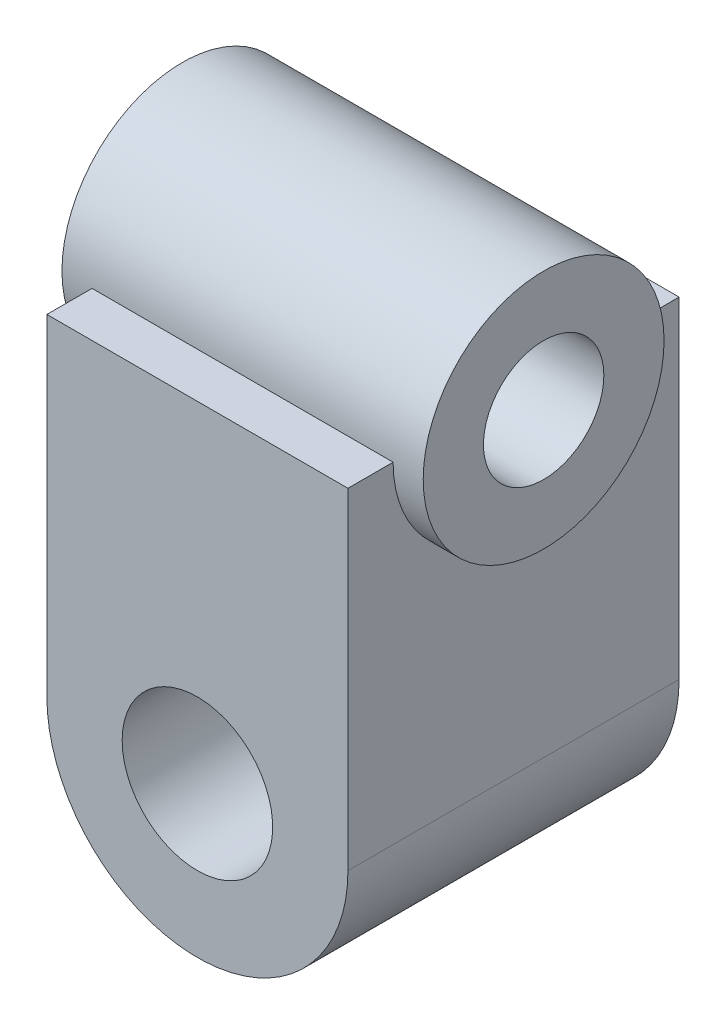
ISO-10303-21;
HEADER;
FILE_DESCRIPTION(('STEP AP214'),'2;1');
FILE_NAME('part.step','',(''),(''),'','','');
FILE_SCHEMA(('AUTOMOTIVE_DESIGN { 1 0 10303 214 1 1 1 1 }'));
ENDSEC;
DATA;
#1=APPLICATION_CONTEXT('core data for automotive mechanical design processes');
#2=APPLICATION_PROTOCOL_DEFINITION('international standard','automotive_design',2000,#1);
#3=PRODUCT_CONTEXT('',#1,'mechanical');
#4=PRODUCT('Part','Part','',(#3));
#5=PRODUCT_RELATED_PRODUCT_CATEGORY('part','',(#4));
#6=PRODUCT_DEFINITION_FORMATION('','',#4);
#7=PRODUCT_DEFINITION_CONTEXT('part definition',#1,'design');
#8=PRODUCT_DEFINITION('design','',#6,#7);
#9=PRODUCT_DEFINITION_SHAPE('','',#8);
#10=(LENGTH_UNIT() NAMED_UNIT(*) SI_UNIT(.MILLI.,.METRE.));
#11=(NAMED_UNIT(*) PLANE_ANGLE_UNIT() SI_UNIT($,.RADIAN.));
#12=(NAMED_UNIT(*) SI_UNIT($,.STERADIAN.) SOLID_ANGLE_UNIT());
#13=UNCERTAINTY_MEASURE_WITH_UNIT(LENGTH_MEASURE(1.E-05),#10,'distance_accuracy_value','');
#14=(GEOMETRIC_REPRESENTATION_CONTEXT(3) GLOBAL_UNCERTAINTY_ASSIGNED_CONTEXT((#13)) GLOBAL_UNIT_ASSIGNED_CONTEXT((#10,
#11,#12)) REPRESENTATION_CONTEXT('',''));
#15=CARTESIAN_POINT('',(0.,0.,0.));
#16=DIRECTION('',(0.,0.,1.));
#17=DIRECTION('',(1.,0.,0.));
#18=AXIS2_PLACEMENT_3D('',#15,#16,#17);
#19=CARTESIAN_POINT('',(0.,69.85,34.925));
#20=DIRECTION('',(0.,1.,0.));
#21=DIRECTION('',(0.,0.,1.));
#22=AXIS2_PLACEMENT_3D('',#19,#20,#21);
#23=PLANE('',#22);
#24=DIRECTION('',(0.,0.,-1.));
#25=VECTOR('',#24,1.);
#26=CARTESIAN_POINT('',(-31.75,69.85,34.925));
#27=LINE('',#26,#25);
#28=CARTESIAN_POINT('',(-31.75,69.85,-25.4));
#29=VERTEX_POINT('',#28);
#30=CARTESIAN_POINT('',(-31.75,69.85,-34.925));
#31=VERTEX_POINT('',#30);
#32=EDGE_CURVE('E78',#29,#31,#27,.T.);
#33=ORIENTED_EDGE('',*,*,#32,.F.);
#34=DIRECTION('',(-1.,0.,0.));
#35=VECTOR('',#34,1.);
#36=CARTESIAN_POINT('',(38.1,69.85,-25.4));
#37=LINE('',#36,#35);
#38=CARTESIAN_POINT('',(31.75,69.85,-25.4));
#39=VERTEX_POINT('',#38);
#40=EDGE_CURVE('E11',#29,#39,#37,.F.);
#41=ORIENTED_EDGE('',*,*,#40,.T.);
#42=DIRECTION('',(0.,0.,-1.));
#43=VECTOR('',#42,1.);
#44=CARTESIAN_POINT('',(31.75,69.85,34.925));
#45=LINE('',#44,#43);
#46=CARTESIAN_POINT('',(31.75,69.85,-34.925));
#47=VERTEX_POINT('',#46);
#48=EDGE_CURVE('E103',#39,#47,#45,.T.);
#49=ORIENTED_EDGE('',*,*,#48,.T.);
#50=DIRECTION('',(1.,0.,0.));
#51=VECTOR('',#50,1.);
#52=CARTESIAN_POINT('',(0.,69.85,-34.925));
#53=LINE('',#52,#51);
#54=EDGE_CURVE('E136',#31,#47,#53,.T.);
#55=ORIENTED_EDGE('',*,*,#54,.F.);
#56=EDGE_LOOP('',(#33,#41,#49,#55));
#57=FACE_BOUND('',#56,.T.);
#58=ADVANCED_FACE('F33',(#57),#23,.T.);
#59=CARTESIAN_POINT('',(31.75,69.85,34.925));
#60=VERTEX_POINT('',#59);
#61=CARTESIAN_POINT('',(31.75,69.85,25.4));
#62=VERTEX_POINT('',#61);
#63=EDGE_CURVE('E101',#60,#62,#45,.T.);
#64=ORIENTED_EDGE('',*,*,#63,.T.);
#65=DIRECTION('',(-1.,0.,0.));
#66=VECTOR('',#65,1.);
#67=CARTESIAN_POINT('',(38.1,69.85,25.4));
#68=LINE('',#67,#66);
#69=CARTESIAN_POINT('',(-31.75,69.85,25.4));
#70=VERTEX_POINT('',#69);
#71=EDGE_CURVE('E41',#62,#70,#68,.T.);
#72=ORIENTED_EDGE('',*,*,#71,.T.);
#73=CARTESIAN_POINT('',(-31.75,69.85,34.925));
#74=VERTEX_POINT('',#73);
#75=EDGE_CURVE('E56',#74,#70,#27,.T.);
#76=ORIENTED_EDGE('',*,*,#75,.F.);
#77=DIRECTION('',(1.,0.,0.));
#78=VECTOR('',#77,1.);
#79=CARTESIAN_POINT('',(0.,69.85,34.925));
#80=LINE('',#79,#78);
#81=EDGE_CURVE('E108',#74,#60,#80,.T.);
#82=ORIENTED_EDGE('',*,*,#81,.T.);
#83=EDGE_LOOP('',(#64,#72,#76,#82));
#84=FACE_BOUND('',#83,.T.);
#85=ADVANCED_FACE('F106',(#84),#23,.T.);
#86=CARTESIAN_POINT('',(-31.75,0.,34.925));
#87=DIRECTION('',(-1.,0.,0.));
#88=DIRECTION('',(0.,0.,1.));
#89=AXIS2_PLACEMENT_3D('',#86,#87,#88);
#90=PLANE('',#89);
#91=ORIENTED_EDGE('',*,*,#75,.T.);
#92=CARTESIAN_POINT('',(-31.75,69.85,0.));
#93=DIRECTION('',(-1.,0.,0.));
#94=DIRECTION('',(0.,0.,1.));
#95=AXIS2_PLACEMENT_3D('',#92,#93,#94);
#96=CIRCLE('',#95,25.4);
#97=EDGE_CURVE('E48',#70,#29,#96,.F.);
#98=ORIENTED_EDGE('',*,*,#97,.T.);
#99=ORIENTED_EDGE('',*,*,#32,.T.);
#100=DIRECTION('',(0.,1.,0.));
#101=VECTOR('',#100,1.);
#102=CARTESIAN_POINT('',(-31.75,0.,-34.925));
#103=LINE('',#102,#101);
#104=CARTESIAN_POINT('',(-31.75,0.,-34.925));
#105=VERTEX_POINT('',#104);
#106=EDGE_CURVE('E127',#105,#31,#103,.T.);
#107=ORIENTED_EDGE('',*,*,#106,.F.);
#108=DIRECTION('',(0.,0.,-1.));
#109=VECTOR('',#108,1.);
#110=CARTESIAN_POINT('',(-31.75,0.,34.925));
#111=LINE('',#110,#109);
#112=CARTESIAN_POINT('',(-31.75,0.,34.925));
#113=VERTEX_POINT('',#112);
#114=EDGE_CURVE('E82',#113,#105,#111,.T.);
#115=ORIENTED_EDGE('',*,*,#114,.F.);
#116=DIRECTION('',(0.,1.,0.));
#117=VECTOR('',#116,1.);
#118=CARTESIAN_POINT('',(-31.75,0.,34.925));
#119=LINE('',#118,#117);
#120=EDGE_CURVE('E137',#113,#74,#119,.T.);
#121=ORIENTED_EDGE('',*,*,#120,.T.);
#122=EDGE_LOOP('',(#91,#98,#99,#107,#115,#121));
#123=FACE_BOUND('',#122,.T.);
#124=ADVANCED_FACE('F35',(#123),#90,.T.);
#125=CARTESIAN_POINT('',(0.,0.,34.925));
#126=DIRECTION('',(0.,0.,-1.));
#127=DIRECTION('',(-1.,0.,0.));
#128=AXIS2_PLACEMENT_3D('',#125,#126,#127);
#129=CYLINDRICAL_SURFACE('',#128,31.75);
#130=CARTESIAN_POINT('',(0.,0.,-34.925));
#131=DIRECTION('',(0.,0.,1.));
#132=DIRECTION('',(1.,0.,0.));
#133=AXIS2_PLACEMENT_3D('',#130,#131,#132);
#134=CIRCLE('',#133,31.75);
#135=CARTESIAN_POINT('',(31.75,0.,-34.925));
#136=VERTEX_POINT('',#135);
#137=EDGE_CURVE('E120',#105,#136,#134,.T.);
#138=ORIENTED_EDGE('',*,*,#137,.T.);
#139=DIRECTION('',(0.,0.,-1.));
#140=VECTOR('',#139,1.);
#141=CARTESIAN_POINT('',(31.75,0.,34.925));
#142=LINE('',#141,#140);
#143=CARTESIAN_POINT('',(31.75,0.,34.925));
#144=VERTEX_POINT('',#143);
#145=EDGE_CURVE('E109',#144,#136,#142,.T.);
#146=ORIENTED_EDGE('',*,*,#145,.F.);
#147=CARTESIAN_POINT('',(0.,0.,34.925));
#148=DIRECTION('',(0.,0.,1.));
#149=DIRECTION('',(1.,0.,0.));
#150=AXIS2_PLACEMENT_3D('',#147,#148,#149);
#151=CIRCLE('',#150,31.75);
#152=EDGE_CURVE('E121',#113,#144,#151,.T.);
#153=ORIENTED_EDGE('',*,*,#152,.F.);
#154=ORIENTED_EDGE('',*,*,#114,.T.);
#155=EDGE_LOOP('',(#138,#146,#153,#154));
#156=FACE_BOUND('',#155,.T.);
#157=ADVANCED_FACE('F118',(#156),#129,.T.);
#158=CARTESIAN_POINT('',(31.75,0.,34.925));
#159=DIRECTION('',(-1.,0.,0.));
#160=DIRECTION('',(0.,0.,1.));
#161=AXIS2_PLACEMENT_3D('',#158,#159,#160);
#162=PLANE('',#161);
#163=CARTESIAN_POINT('',(31.75,69.85,0.));
#164=DIRECTION('',(-1.,0.,0.));
#165=DIRECTION('',(0.,0.,1.));
#166=AXIS2_PLACEMENT_3D('',#163,#164,#165);
#167=CIRCLE('',#166,25.4);
#168=EDGE_CURVE('E94',#62,#39,#167,.F.);
#169=ORIENTED_EDGE('',*,*,#168,.F.);
#170=ORIENTED_EDGE('',*,*,#63,.F.);
#171=DIRECTION('',(0.,1.,0.));
#172=VECTOR('',#171,1.);
#173=CARTESIAN_POINT('',(31.75,0.,34.925));
#174=LINE('',#173,#172);
#175=EDGE_CURVE('E139',#144,#60,#174,.T.);
#176=ORIENTED_EDGE('',*,*,#175,.F.);
#177=ORIENTED_EDGE('',*,*,#145,.T.);
#178=DIRECTION('',(0.,1.,0.));
#179=VECTOR('',#178,1.);
#180=CARTESIAN_POINT('',(31.75,0.,-34.925));
#181=LINE('',#180,#179);
#182=EDGE_CURVE('E129',#136,#47,#181,.T.);
#183=ORIENTED_EDGE('',*,*,#182,.T.);
#184=ORIENTED_EDGE('',*,*,#48,.F.);
#185=EDGE_LOOP('',(#169,#170,#176,#177,#183,#184));
#186=FACE_BOUND('',#185,.T.);
#187=ADVANCED_FACE('F99',(#186),#162,.F.);
#188=CARTESIAN_POINT('',(0.,0.,34.925));
#189=DIRECTION('',(0.,0.,1.));
#190=DIRECTION('',(1.,0.,0.));
#191=AXIS2_PLACEMENT_3D('',#188,#189,#190);
#192=PLANE('',#191);
#193=CARTESIAN_POINT('',(0.,0.,34.925));
#194=DIRECTION('',(0.,0.,-1.));
#195=DIRECTION('',(-1.,0.,0.));
#196=AXIS2_PLACEMENT_3D('',#193,#194,#195);
#197=CIRCLE('',#196,15.875);
#198=CARTESIAN_POINT('',(-15.875,0.,34.925));
#199=VERTEX_POINT('',#198);
#200=EDGE_CURVE('E266',#199,#199,#197,.T.);
#201=ORIENTED_EDGE('',*,*,#200,.T.);
#202=EDGE_LOOP('',(#201));
#203=FACE_BOUND('',#202,.T.);
#204=ORIENTED_EDGE('',*,*,#120,.F.);
#205=ORIENTED_EDGE('',*,*,#152,.T.);
#206=ORIENTED_EDGE('',*,*,#175,.T.);
#207=ORIENTED_EDGE('',*,*,#81,.F.);
#208=EDGE_LOOP('',(#204,#205,#206,#207));
#209=FACE_BOUND('',#208,.T.);
#210=ADVANCED_FACE('F152',(#203,#209),#192,.T.);
#211=CARTESIAN_POINT('',(0.,0.,-34.925));
#212=DIRECTION('',(0.,0.,1.));
#213=DIRECTION('',(1.,0.,0.));
#214=AXIS2_PLACEMENT_3D('',#211,#212,#213);
#215=PLANE('',#214);
#216=CARTESIAN_POINT('',(0.,0.,-34.925));
#217=DIRECTION('',(0.,0.,-1.));
#218=DIRECTION('',(-1.,0.,0.));
#219=AXIS2_PLACEMENT_3D('',#216,#217,#218);
#220=CIRCLE('',#219,15.875);
#221=CARTESIAN_POINT('',(-15.875,0.,-34.925));
#222=VERTEX_POINT('',#221);
#223=EDGE_CURVE('E269',#222,#222,#220,.T.);
#224=ORIENTED_EDGE('',*,*,#223,.F.);
#225=EDGE_LOOP('',(#224));
#226=FACE_BOUND('',#225,.T.);
#227=ORIENTED_EDGE('',*,*,#106,.T.);
#228=ORIENTED_EDGE('',*,*,#54,.T.);
#229=ORIENTED_EDGE('',*,*,#182,.F.);
#230=ORIENTED_EDGE('',*,*,#137,.F.);
#231=EDGE_LOOP('',(#227,#228,#229,#230));
#232=FACE_BOUND('',#231,.T.);
#233=ADVANCED_FACE('F125',(#226,#232),#215,.F.);
#234=CARTESIAN_POINT('',(38.1,69.85,0.));
#235=DIRECTION('',(-1.,0.,0.));
#236=DIRECTION('',(0.,0.,1.));
#237=AXIS2_PLACEMENT_3D('',#234,#235,#236);
#238=CYLINDRICAL_SURFACE('',#237,25.4);
#239=ORIENTED_EDGE('',*,*,#40,.F.);
#240=ORIENTED_EDGE('',*,*,#97,.F.);
#241=ORIENTED_EDGE('',*,*,#71,.F.);
#242=ORIENTED_EDGE('',*,*,#168,.T.);
#243=EDGE_LOOP('',(#239,#240,#241,#242));
#244=FACE_BOUND('',#243,.T.);
#245=CARTESIAN_POINT('',(38.1,69.85,0.));
#246=DIRECTION('',(1.,0.,0.));
#247=DIRECTION('',(0.,0.,-1.));
#248=AXIS2_PLACEMENT_3D('',#245,#246,#247);
#249=CIRCLE('',#248,25.4);
#250=CARTESIAN_POINT('',(38.1,69.85,-25.4));
#251=VERTEX_POINT('',#250);
#252=EDGE_CURVE('E104',#251,#251,#249,.T.);
#253=ORIENTED_EDGE('',*,*,#252,.F.);
#254=EDGE_LOOP('',(#253));
#255=FACE_BOUND('',#254,.T.);
#256=CARTESIAN_POINT('',(-38.1,69.85,0.));
#257=DIRECTION('',(1.,0.,0.));
#258=DIRECTION('',(0.,0.,-1.));
#259=AXIS2_PLACEMENT_3D('',#256,#257,#258);
#260=CIRCLE('',#259,25.4);
#261=CARTESIAN_POINT('',(-38.1,69.85,-25.4));
#262=VERTEX_POINT('',#261);
#263=EDGE_CURVE('E257',#262,#262,#260,.T.);
#264=ORIENTED_EDGE('',*,*,#263,.T.);
#265=EDGE_LOOP('',(#264));
#266=FACE_BOUND('',#265,.T.);
#267=ADVANCED_FACE('F92',(#244,#255,#266),#238,.T.);
#268=CARTESIAN_POINT('',(38.1,69.85,0.));
#269=DIRECTION('',(1.,0.,0.));
#270=DIRECTION('',(0.,0.,-1.));
#271=AXIS2_PLACEMENT_3D('',#268,#269,#270);
#272=PLANE('',#271);
#273=CARTESIAN_POINT('',(38.1,69.85,0.));
#274=DIRECTION('',(1.,0.,0.));
#275=DIRECTION('',(0.,0.,-1.));
#276=AXIS2_PLACEMENT_3D('',#273,#274,#275);
#277=CIRCLE('',#276,12.7);
#278=CARTESIAN_POINT('',(38.1,69.85,-12.7));
#279=VERTEX_POINT('',#278);
#280=EDGE_CURVE('E254',#279,#279,#277,.T.);
#281=ORIENTED_EDGE('',*,*,#280,.F.);
#282=EDGE_LOOP('',(#281));
#283=FACE_BOUND('',#282,.T.);
#284=ORIENTED_EDGE('',*,*,#252,.T.);
#285=EDGE_LOOP('',(#284));
#286=FACE_BOUND('',#285,.T.);
#287=ADVANCED_FACE('F229',(#283,#286),#272,.T.);
#288=CARTESIAN_POINT('',(-38.1,69.85,0.));
#289=DIRECTION('',(1.,0.,0.));
#290=DIRECTION('',(0.,0.,-1.));
#291=AXIS2_PLACEMENT_3D('',#288,#289,#290);
#292=PLANE('',#291);
#293=CARTESIAN_POINT('',(-38.1,69.85,0.));
#294=DIRECTION('',(1.,0.,0.));
#295=DIRECTION('',(0.,0.,-1.));
#296=AXIS2_PLACEMENT_3D('',#293,#294,#295);
#297=CIRCLE('',#296,12.7);
#298=CARTESIAN_POINT('',(-38.1,69.85,-12.7));
#299=VERTEX_POINT('',#298);
#300=EDGE_CURVE('E260',#299,#299,#297,.T.);
#301=ORIENTED_EDGE('',*,*,#300,.T.);
#302=EDGE_LOOP('',(#301));
#303=FACE_BOUND('',#302,.T.);
#304=ORIENTED_EDGE('',*,*,#263,.F.);
#305=EDGE_LOOP('',(#304));
#306=FACE_BOUND('',#305,.T.);
#307=ADVANCED_FACE('F222',(#303,#306),#292,.F.);
#308=CARTESIAN_POINT('',(38.1,69.85,0.));
#309=DIRECTION('',(1.,0.,0.));
#310=DIRECTION('',(0.,0.,-1.));
#311=AXIS2_PLACEMENT_3D('',#308,#309,#310);
#312=CYLINDRICAL_SURFACE('',#311,12.7);
#313=ORIENTED_EDGE('',*,*,#300,.F.);
#314=EDGE_LOOP('',(#313));
#315=FACE_BOUND('',#314,.T.);
#316=ORIENTED_EDGE('',*,*,#280,.T.);
#317=EDGE_LOOP('',(#316));
#318=FACE_BOUND('',#317,.T.);
#319=ADVANCED_FACE('F212',(#315,#318),#312,.F.);
#320=CARTESIAN_POINT('',(0.,0.,-34.925));
#321=DIRECTION('',(0.,0.,-1.));
#322=DIRECTION('',(-1.,0.,0.));
#323=AXIS2_PLACEMENT_3D('',#320,#321,#322);
#324=CYLINDRICAL_SURFACE('',#323,15.875);
#325=ORIENTED_EDGE('',*,*,#200,.F.);
#326=EDGE_LOOP('',(#325));
#327=FACE_BOUND('',#326,.T.);
#328=ORIENTED_EDGE('',*,*,#223,.T.);
#329=EDGE_LOOP('',(#328));
#330=FACE_BOUND('',#329,.T.);
#331=ADVANCED_FACE('F208',(#327,#330),#324,.F.);
#332=CLOSED_SHELL('',(#58,#85,#124,#157,#187,#210,#233,#267,#287,#307,#319,#331));
#333=MANIFOLD_SOLID_BREP('B2',#332);
#334=ADVANCED_BREP_SHAPE_REPRESENTATION('',(#18,#333),#14);
#335=SHAPE_DEFINITION_REPRESENTATION(#9,#334);
ENDSEC;
END-ISO-10303-21;
